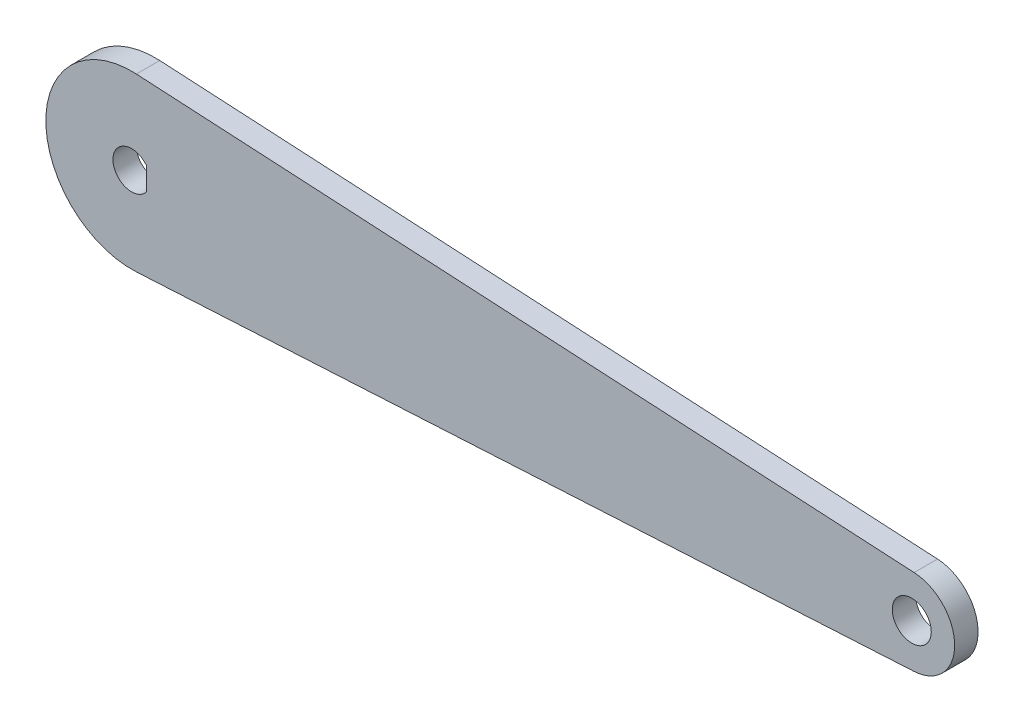
ISO-10303-21;
HEADER;
FILE_DESCRIPTION(('STEP AP214'),'2;1');
FILE_NAME('part.step','',(''),(''),'','','');
FILE_SCHEMA(('AUTOMOTIVE_DESIGN { 1 0 10303 214 1 1 1 1 }'));
ENDSEC;
DATA;
#1=APPLICATION_CONTEXT('core data for automotive mechanical design processes');
#2=APPLICATION_PROTOCOL_DEFINITION('international standard','automotive_design',2000,#1);
#3=PRODUCT_CONTEXT('',#1,'mechanical');
#4=PRODUCT('Part','Part','',(#3));
#5=PRODUCT_RELATED_PRODUCT_CATEGORY('part','',(#4));
#6=PRODUCT_DEFINITION_FORMATION('','',#4);
#7=PRODUCT_DEFINITION_CONTEXT('part definition',#1,'design');
#8=PRODUCT_DEFINITION('design','',#6,#7);
#9=PRODUCT_DEFINITION_SHAPE('','',#8);
#10=(LENGTH_UNIT() NAMED_UNIT(*) SI_UNIT(.MILLI.,.METRE.));
#11=(NAMED_UNIT(*) PLANE_ANGLE_UNIT() SI_UNIT($,.RADIAN.));
#12=(NAMED_UNIT(*) SI_UNIT($,.STERADIAN.) SOLID_ANGLE_UNIT());
#13=UNCERTAINTY_MEASURE_WITH_UNIT(LENGTH_MEASURE(1.E-05),#10,'distance_accuracy_value','');
#14=(GEOMETRIC_REPRESENTATION_CONTEXT(3) GLOBAL_UNCERTAINTY_ASSIGNED_CONTEXT((#13)) GLOBAL_UNIT_ASSIGNED_CONTEXT((#10,
#11,#12)) REPRESENTATION_CONTEXT('',''));
#15=CARTESIAN_POINT('',(0.,0.,0.));
#16=DIRECTION('',(0.,0.,1.));
#17=DIRECTION('',(1.,0.,0.));
#18=AXIS2_PLACEMENT_3D('',#15,#16,#17);
#19=CARTESIAN_POINT('',(0.,0.,3.));
#20=DIRECTION('',(0.,0.,1.));
#21=DIRECTION('',(1.,0.,0.));
#22=AXIS2_PLACEMENT_3D('',#19,#20,#21);
#23=PLANE('',#22);
#24=CARTESIAN_POINT('',(0.,0.,3.));
#25=DIRECTION('',(0.,0.,1.));
#26=DIRECTION('',(1.,0.,0.));
#27=AXIS2_PLACEMENT_3D('',#24,#25,#26);
#28=CIRCLE('',#27,2.4);
#29=CARTESIAN_POINT('',(1.9,1.46628782986152,3.));
#30=VERTEX_POINT('',#29);
#31=CARTESIAN_POINT('',(1.9,-1.46628782986152,3.));
#32=VERTEX_POINT('',#31);
#33=EDGE_CURVE('E48',#30,#32,#28,.T.);
#34=ORIENTED_EDGE('',*,*,#33,.F.);
#35=DIRECTION('',(0.,1.,0.));
#36=VECTOR('',#35,1.);
#37=CARTESIAN_POINT('',(1.9,1.46628782986152,3.));
#38=LINE('',#37,#36);
#39=EDGE_CURVE('E97',#32,#30,#38,.T.);
#40=ORIENTED_EDGE('',*,*,#39,.F.);
#41=EDGE_LOOP('',(#34,#40));
#42=FACE_BOUND('',#41,.T.);
#43=CARTESIAN_POINT('',(0.,0.,3.));
#44=DIRECTION('',(0.,0.,1.));
#45=DIRECTION('',(1.,0.,0.));
#46=AXIS2_PLACEMENT_3D('',#43,#44,#45);
#47=CIRCLE('',#46,11.);
#48=CARTESIAN_POINT('',(0.605,10.9833498988241,3.));
#49=VERTEX_POINT('',#48);
#50=CARTESIAN_POINT('',(0.605,-10.9833498988241,3.));
#51=VERTEX_POINT('',#50);
#52=EDGE_CURVE('E110',#49,#51,#47,.T.);
#53=ORIENTED_EDGE('',*,*,#52,.T.);
#54=DIRECTION('',(0.998486354438557,0.055,0.));
#55=VECTOR('',#54,1.);
#56=CARTESIAN_POINT('',(0.605,-10.9833498988241,3.));
#57=LINE('',#56,#55);
#58=CARTESIAN_POINT('',(100.3025,-5.49167494941206,3.));
#59=VERTEX_POINT('',#58);
#60=EDGE_CURVE('E113',#51,#59,#57,.T.);
#61=ORIENTED_EDGE('',*,*,#60,.T.);
#62=CARTESIAN_POINT('',(100.,0.,3.));
#63=DIRECTION('',(0.,0.,1.));
#64=DIRECTION('',(1.,0.,0.));
#65=AXIS2_PLACEMENT_3D('',#62,#63,#64);
#66=CIRCLE('',#65,5.5);
#67=CARTESIAN_POINT('',(100.3025,5.49167494941206,3.));
#68=VERTEX_POINT('',#67);
#69=EDGE_CURVE('E116',#59,#68,#66,.T.);
#70=ORIENTED_EDGE('',*,*,#69,.T.);
#71=DIRECTION('',(-0.998486354438557,0.055,0.));
#72=VECTOR('',#71,1.);
#73=CARTESIAN_POINT('',(0.605,10.9833498988241,3.));
#74=LINE('',#73,#72);
#75=EDGE_CURVE('E118',#68,#49,#74,.T.);
#76=ORIENTED_EDGE('',*,*,#75,.T.);
#77=EDGE_LOOP('',(#53,#61,#70,#76));
#78=FACE_BOUND('',#77,.T.);
#79=CARTESIAN_POINT('',(100.,0.,3.));
#80=DIRECTION('',(0.,0.,1.));
#81=DIRECTION('',(1.,0.,0.));
#82=AXIS2_PLACEMENT_3D('',#79,#80,#81);
#83=CIRCLE('',#82,2.5);
#84=CARTESIAN_POINT('',(102.5,0.,3.));
#85=VERTEX_POINT('',#84);
#86=EDGE_CURVE('E104',#85,#85,#83,.T.);
#87=ORIENTED_EDGE('',*,*,#86,.F.);
#88=EDGE_LOOP('',(#87));
#89=FACE_BOUND('',#88,.T.);
#90=ADVANCED_FACE('F33',(#42,#78,#89),#23,.T.);
#91=CARTESIAN_POINT('',(0.,0.,0.));
#92=DIRECTION('',(0.,0.,1.));
#93=DIRECTION('',(1.,0.,0.));
#94=AXIS2_PLACEMENT_3D('',#91,#92,#93);
#95=PLANE('',#94);
#96=DIRECTION('',(0.,1.,0.));
#97=VECTOR('',#96,1.);
#98=CARTESIAN_POINT('',(1.9,1.46628782986152,0.));
#99=LINE('',#98,#97);
#100=CARTESIAN_POINT('',(1.9,-1.46628782986152,0.));
#101=VERTEX_POINT('',#100);
#102=CARTESIAN_POINT('',(1.9,1.46628782986152,0.));
#103=VERTEX_POINT('',#102);
#104=EDGE_CURVE('E89',#101,#103,#99,.T.);
#105=ORIENTED_EDGE('',*,*,#104,.T.);
#106=CARTESIAN_POINT('',(0.,0.,0.));
#107=DIRECTION('',(0.,0.,1.));
#108=DIRECTION('',(1.,0.,0.));
#109=AXIS2_PLACEMENT_3D('',#106,#107,#108);
#110=CIRCLE('',#109,2.4);
#111=EDGE_CURVE('E53',#103,#101,#110,.T.);
#112=ORIENTED_EDGE('',*,*,#111,.T.);
#113=EDGE_LOOP('',(#105,#112));
#114=FACE_BOUND('',#113,.T.);
#115=CARTESIAN_POINT('',(0.,0.,0.));
#116=DIRECTION('',(0.,0.,1.));
#117=DIRECTION('',(1.,0.,0.));
#118=AXIS2_PLACEMENT_3D('',#115,#116,#117);
#119=CIRCLE('',#118,11.);
#120=CARTESIAN_POINT('',(0.605,10.9833498988241,0.));
#121=VERTEX_POINT('',#120);
#122=CARTESIAN_POINT('',(0.605,-10.9833498988241,0.));
#123=VERTEX_POINT('',#122);
#124=EDGE_CURVE('E107',#121,#123,#119,.T.);
#125=ORIENTED_EDGE('',*,*,#124,.F.);
#126=DIRECTION('',(-0.998486354438557,0.055,0.));
#127=VECTOR('',#126,1.);
#128=CARTESIAN_POINT('',(0.605,10.9833498988241,0.));
#129=LINE('',#128,#127);
#130=CARTESIAN_POINT('',(100.3025,5.49167494941206,0.));
#131=VERTEX_POINT('',#130);
#132=EDGE_CURVE('E114',#131,#121,#129,.T.);
#133=ORIENTED_EDGE('',*,*,#132,.F.);
#134=CARTESIAN_POINT('',(100.,0.,0.));
#135=DIRECTION('',(0.,0.,1.));
#136=DIRECTION('',(1.,0.,0.));
#137=AXIS2_PLACEMENT_3D('',#134,#135,#136);
#138=CIRCLE('',#137,5.5);
#139=CARTESIAN_POINT('',(100.3025,-5.49167494941206,0.));
#140=VERTEX_POINT('',#139);
#141=EDGE_CURVE('E125',#140,#131,#138,.T.);
#142=ORIENTED_EDGE('',*,*,#141,.F.);
#143=DIRECTION('',(0.998486354438557,0.055,0.));
#144=VECTOR('',#143,1.);
#145=CARTESIAN_POINT('',(0.605,-10.9833498988241,0.));
#146=LINE('',#145,#144);
#147=EDGE_CURVE('E123',#123,#140,#146,.T.);
#148=ORIENTED_EDGE('',*,*,#147,.F.);
#149=EDGE_LOOP('',(#125,#133,#142,#148));
#150=FACE_BOUND('',#149,.T.);
#151=CARTESIAN_POINT('',(100.,0.,0.));
#152=DIRECTION('',(0.,0.,1.));
#153=DIRECTION('',(1.,0.,0.));
#154=AXIS2_PLACEMENT_3D('',#151,#152,#153);
#155=CIRCLE('',#154,2.5);
#156=CARTESIAN_POINT('',(102.5,0.,0.));
#157=VERTEX_POINT('',#156);
#158=EDGE_CURVE('E102',#157,#157,#155,.T.);
#159=ORIENTED_EDGE('',*,*,#158,.T.);
#160=EDGE_LOOP('',(#159));
#161=FACE_BOUND('',#160,.T.);
#162=ADVANCED_FACE('F95',(#114,#150,#161),#95,.F.);
#163=CARTESIAN_POINT('',(0.,0.,3.));
#164=DIRECTION('',(0.,0.,-1.));
#165=DIRECTION('',(-1.,0.,0.));
#166=AXIS2_PLACEMENT_3D('',#163,#164,#165);
#167=CYLINDRICAL_SURFACE('',#166,11.);
#168=ORIENTED_EDGE('',*,*,#124,.T.);
#169=DIRECTION('',(0.,0.,-1.));
#170=VECTOR('',#169,1.);
#171=CARTESIAN_POINT('',(0.605,-10.9833498988241,3.));
#172=LINE('',#171,#170);
#173=EDGE_CURVE('E11',#51,#123,#172,.T.);
#174=ORIENTED_EDGE('',*,*,#173,.F.);
#175=ORIENTED_EDGE('',*,*,#52,.F.);
#176=DIRECTION('',(0.,0.,-1.));
#177=VECTOR('',#176,1.);
#178=CARTESIAN_POINT('',(0.605,10.9833498988241,3.));
#179=LINE('',#178,#177);
#180=EDGE_CURVE('E120',#49,#121,#179,.T.);
#181=ORIENTED_EDGE('',*,*,#180,.T.);
#182=EDGE_LOOP('',(#168,#174,#175,#181));
#183=FACE_BOUND('',#182,.T.);
#184=ADVANCED_FACE('F35',(#183),#167,.T.);
#185=CARTESIAN_POINT('',(0.605,-10.9833498988241,3.));
#186=DIRECTION('',(-0.055,0.998486354438557,0.));
#187=DIRECTION('',(-0.998486354438557,-0.055,0.));
#188=AXIS2_PLACEMENT_3D('',#185,#186,#187);
#189=PLANE('',#188);
#190=ORIENTED_EDGE('',*,*,#147,.T.);
#191=DIRECTION('',(0.,0.,-1.));
#192=VECTOR('',#191,1.);
#193=CARTESIAN_POINT('',(100.3025,-5.49167494941206,3.));
#194=LINE('',#193,#192);
#195=EDGE_CURVE('E41',#59,#140,#194,.T.);
#196=ORIENTED_EDGE('',*,*,#195,.F.);
#197=ORIENTED_EDGE('',*,*,#60,.F.);
#198=ORIENTED_EDGE('',*,*,#173,.T.);
#199=EDGE_LOOP('',(#190,#196,#197,#198));
#200=FACE_BOUND('',#199,.T.);
#201=ADVANCED_FACE('F152',(#200),#189,.F.);
#202=CARTESIAN_POINT('',(100.,0.,3.));
#203=DIRECTION('',(0.,0.,-1.));
#204=DIRECTION('',(-1.,0.,0.));
#205=AXIS2_PLACEMENT_3D('',#202,#203,#204);
#206=CYLINDRICAL_SURFACE('',#205,5.5);
#207=ORIENTED_EDGE('',*,*,#141,.T.);
#208=DIRECTION('',(0.,0.,-1.));
#209=VECTOR('',#208,1.);
#210=CARTESIAN_POINT('',(100.3025,5.49167494941206,3.));
#211=LINE('',#210,#209);
#212=EDGE_CURVE('E130',#68,#131,#211,.T.);
#213=ORIENTED_EDGE('',*,*,#212,.F.);
#214=ORIENTED_EDGE('',*,*,#69,.F.);
#215=ORIENTED_EDGE('',*,*,#195,.T.);
#216=EDGE_LOOP('',(#207,#213,#214,#215));
#217=FACE_BOUND('',#216,.T.);
#218=ADVANCED_FACE('F137',(#217),#206,.T.);
#219=CARTESIAN_POINT('',(0.605,10.9833498988241,3.));
#220=DIRECTION('',(-0.055,-0.998486354438557,0.));
#221=DIRECTION('',(0.998486354438557,-0.055,0.));
#222=AXIS2_PLACEMENT_3D('',#219,#220,#221);
#223=PLANE('',#222);
#224=ORIENTED_EDGE('',*,*,#132,.T.);
#225=ORIENTED_EDGE('',*,*,#180,.F.);
#226=ORIENTED_EDGE('',*,*,#75,.F.);
#227=ORIENTED_EDGE('',*,*,#212,.T.);
#228=EDGE_LOOP('',(#224,#225,#226,#227));
#229=FACE_BOUND('',#228,.T.);
#230=ADVANCED_FACE('F145',(#229),#223,.F.);
#231=CARTESIAN_POINT('',(100.,0.,3.));
#232=DIRECTION('',(0.,0.,-1.));
#233=DIRECTION('',(-1.,0.,0.));
#234=AXIS2_PLACEMENT_3D('',#231,#232,#233);
#235=CYLINDRICAL_SURFACE('',#234,2.5);
#236=ORIENTED_EDGE('',*,*,#86,.T.);
#237=EDGE_LOOP('',(#236));
#238=FACE_BOUND('',#237,.T.);
#239=ORIENTED_EDGE('',*,*,#158,.F.);
#240=EDGE_LOOP('',(#239));
#241=FACE_BOUND('',#240,.T.);
#242=ADVANCED_FACE('F167',(#238,#241),#235,.F.);
#243=CARTESIAN_POINT('',(0.,0.,0.));
#244=DIRECTION('',(0.,0.,1.));
#245=DIRECTION('',(1.,0.,0.));
#246=AXIS2_PLACEMENT_3D('',#243,#244,#245);
#247=CYLINDRICAL_SURFACE('',#246,2.4);
#248=ORIENTED_EDGE('',*,*,#33,.T.);
#249=DIRECTION('',(0.,0.,1.));
#250=VECTOR('',#249,1.);
#251=CARTESIAN_POINT('',(1.9,-1.46628782986152,0.));
#252=LINE('',#251,#250);
#253=EDGE_CURVE('E82',#101,#32,#252,.T.);
#254=ORIENTED_EDGE('',*,*,#253,.F.);
#255=ORIENTED_EDGE('',*,*,#111,.F.);
#256=DIRECTION('',(0.,0.,1.));
#257=VECTOR('',#256,1.);
#258=CARTESIAN_POINT('',(1.9,1.46628782986152,0.));
#259=LINE('',#258,#257);
#260=EDGE_CURVE('E88',#103,#30,#259,.T.);
#261=ORIENTED_EDGE('',*,*,#260,.T.);
#262=EDGE_LOOP('',(#248,#254,#255,#261));
#263=FACE_BOUND('',#262,.T.);
#264=ADVANCED_FACE('F84',(#263),#247,.F.);
#265=CARTESIAN_POINT('',(1.9,1.46628782986152,0.));
#266=DIRECTION('',(1.,0.,0.));
#267=DIRECTION('',(0.,0.,-1.));
#268=AXIS2_PLACEMENT_3D('',#265,#266,#267);
#269=PLANE('',#268);
#270=ORIENTED_EDGE('',*,*,#39,.T.);
#271=ORIENTED_EDGE('',*,*,#260,.F.);
#272=ORIENTED_EDGE('',*,*,#104,.F.);
#273=ORIENTED_EDGE('',*,*,#253,.T.);
#274=EDGE_LOOP('',(#270,#271,#272,#273));
#275=FACE_BOUND('',#274,.T.);
#276=ADVANCED_FACE('F92',(#275),#269,.F.);
#277=CLOSED_SHELL('',(#90,#162,#184,#201,#218,#230,#242,#264,#276));
#278=MANIFOLD_SOLID_BREP('B2',#277);
#279=ADVANCED_BREP_SHAPE_REPRESENTATION('',(#18,#278),#14);
#280=SHAPE_DEFINITION_REPRESENTATION(#9,#279);
ENDSEC;
END-ISO-10303-21;
